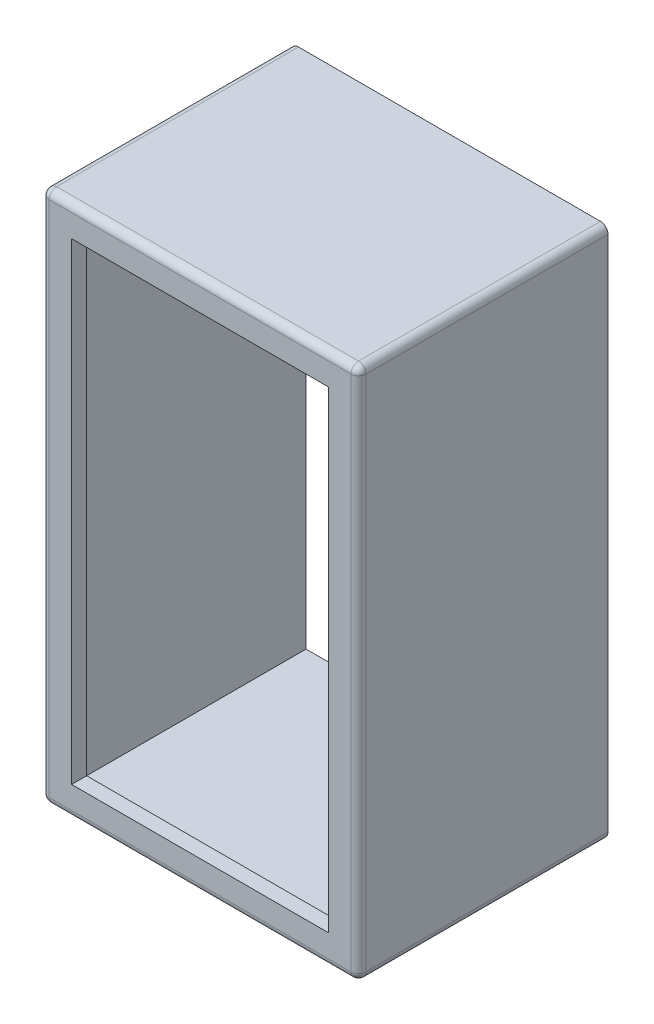
ISO-10303-21;
HEADER;
FILE_DESCRIPTION(('STEP AP214'),'2;1');
FILE_NAME('part.step','',(''),(''),'','','');
FILE_SCHEMA(('AUTOMOTIVE_DESIGN { 1 0 10303 214 1 1 1 1 }'));
ENDSEC;
DATA;
#1=APPLICATION_CONTEXT('core data for automotive mechanical design processes');
#2=APPLICATION_PROTOCOL_DEFINITION('international standard','automotive_design',2000,#1);
#3=PRODUCT_CONTEXT('',#1,'mechanical');
#4=PRODUCT('Part','Part','',(#3));
#5=PRODUCT_RELATED_PRODUCT_CATEGORY('part','',(#4));
#6=PRODUCT_DEFINITION_FORMATION('','',#4);
#7=PRODUCT_DEFINITION_CONTEXT('part definition',#1,'design');
#8=PRODUCT_DEFINITION('design','',#6,#7);
#9=PRODUCT_DEFINITION_SHAPE('','',#8);
#10=(LENGTH_UNIT() NAMED_UNIT(*) SI_UNIT(.MILLI.,.METRE.));
#11=(NAMED_UNIT(*) PLANE_ANGLE_UNIT() SI_UNIT($,.RADIAN.));
#12=(NAMED_UNIT(*) SI_UNIT($,.STERADIAN.) SOLID_ANGLE_UNIT());
#13=UNCERTAINTY_MEASURE_WITH_UNIT(LENGTH_MEASURE(1.E-05),#10,'distance_accuracy_value','');
#14=(GEOMETRIC_REPRESENTATION_CONTEXT(3) GLOBAL_UNCERTAINTY_ASSIGNED_CONTEXT((#13)) GLOBAL_UNIT_ASSIGNED_CONTEXT((#10,
#11,#12)) REPRESENTATION_CONTEXT('',''));
#15=CARTESIAN_POINT('',(0.,0.,0.));
#16=DIRECTION('',(0.,0.,1.));
#17=DIRECTION('',(1.,0.,0.));
#18=AXIS2_PLACEMENT_3D('',#15,#16,#17);
#19=CARTESIAN_POINT('',(9.30389435070419,50.8956969127035,7.9375));
#20=DIRECTION('',(1.,0.,0.));
#21=DIRECTION('',(0.,1.,0.));
#22=AXIS2_PLACEMENT_3D('',#19,#20,#21);
#23=PLANE('',#22);
#24=DIRECTION('',(0.,-1.,0.));
#25=VECTOR('',#24,1.);
#26=CARTESIAN_POINT('',(9.30389435070419,50.8956969127035,8.1915));
#27=LINE('',#26,#25);
#28=CARTESIAN_POINT('',(9.3038943507042,33.1156969127037,8.1915));
#29=VERTEX_POINT('',#28);
#30=CARTESIAN_POINT('',(9.30389435070419,50.6416969127035,8.1915));
#31=VERTEX_POINT('',#30);
#32=EDGE_CURVE('E269',#29,#31,#27,.F.);
#33=ORIENTED_EDGE('',*,*,#32,.T.);
#34=DIRECTION('',(0.,0.,-1.));
#35=VECTOR('',#34,1.);
#36=CARTESIAN_POINT('',(9.30389435070419,50.6416969127035,7.9375));
#37=LINE('',#36,#35);
#38=CARTESIAN_POINT('',(9.30389435070419,50.6416969127035,0.));
#39=VERTEX_POINT('',#38);
#40=EDGE_CURVE('E273',#31,#39,#37,.T.);
#41=ORIENTED_EDGE('',*,*,#40,.T.);
#42=DIRECTION('',(0.,-1.,0.));
#43=VECTOR('',#42,1.);
#44=CARTESIAN_POINT('',(9.30389435070419,50.8956969127035,0.));
#45=LINE('',#44,#43);
#46=CARTESIAN_POINT('',(9.3038943507042,33.1156969127037,0.));
#47=VERTEX_POINT('',#46);
#48=EDGE_CURVE('E227',#39,#47,#45,.T.);
#49=ORIENTED_EDGE('',*,*,#48,.T.);
#50=DIRECTION('',(0.,0.,-1.));
#51=VECTOR('',#50,1.);
#52=CARTESIAN_POINT('',(9.3038943507042,33.1156969127037,7.9375));
#53=LINE('',#52,#51);
#54=EDGE_CURVE('E271',#47,#29,#53,.F.);
#55=ORIENTED_EDGE('',*,*,#54,.T.);
#56=EDGE_LOOP('',(#33,#41,#49,#55));
#57=FACE_BOUND('',#56,.T.);
#58=ADVANCED_FACE('F56',(#57),#23,.F.);
#59=CARTESIAN_POINT('',(9.3038943507042,32.8616969127037,7.9375));
#60=DIRECTION('',(0.,1.,0.));
#61=DIRECTION('',(0.,0.,1.));
#62=AXIS2_PLACEMENT_3D('',#59,#60,#61);
#63=PLANE('',#62);
#64=DIRECTION('',(1.,0.,0.));
#65=VECTOR('',#64,1.);
#66=CARTESIAN_POINT('',(9.3038943507042,32.8616969127037,0.));
#67=LINE('',#66,#65);
#68=CARTESIAN_POINT('',(9.5578943507042,32.8616969127037,0.));
#69=VERTEX_POINT('',#68);
#70=CARTESIAN_POINT('',(19.7813943507042,32.8616969127037,0.));
#71=VERTEX_POINT('',#70);
#72=EDGE_CURVE('E260',#69,#71,#67,.T.);
#73=ORIENTED_EDGE('',*,*,#72,.T.);
#74=DIRECTION('',(0.,0.,-1.));
#75=VECTOR('',#74,1.);
#76=CARTESIAN_POINT('',(19.7813943507042,32.8616969127037,7.9375));
#77=LINE('',#76,#75);
#78=CARTESIAN_POINT('',(19.7813943507042,32.8616969127037,8.1915));
#79=VERTEX_POINT('',#78);
#80=EDGE_CURVE('E300',#71,#79,#77,.F.);
#81=ORIENTED_EDGE('',*,*,#80,.T.);
#82=DIRECTION('',(1.,0.,0.));
#83=VECTOR('',#82,1.);
#84=CARTESIAN_POINT('',(9.3038943507042,32.8616969127037,8.1915));
#85=LINE('',#84,#83);
#86=CARTESIAN_POINT('',(9.5578943507042,32.8616969127037,8.1915));
#87=VERTEX_POINT('',#86);
#88=EDGE_CURVE('E296',#79,#87,#85,.F.);
#89=ORIENTED_EDGE('',*,*,#88,.T.);
#90=DIRECTION('',(0.,0.,-1.));
#91=VECTOR('',#90,1.);
#92=CARTESIAN_POINT('',(9.5578943507042,32.8616969127037,7.9375));
#93=LINE('',#92,#91);
#94=EDGE_CURVE('E298',#87,#69,#93,.T.);
#95=ORIENTED_EDGE('',*,*,#94,.T.);
#96=EDGE_LOOP('',(#73,#81,#89,#95));
#97=FACE_BOUND('',#96,.T.);
#98=ADVANCED_FACE('F392',(#97),#63,.F.);
#99=CARTESIAN_POINT('',(20.0353943507042,50.8956969127035,7.9375));
#100=DIRECTION('',(-1.,0.,0.));
#101=DIRECTION('',(0.,0.,1.));
#102=AXIS2_PLACEMENT_3D('',#99,#100,#101);
#103=PLANE('',#102);
#104=DIRECTION('',(0.,1.,0.));
#105=VECTOR('',#104,1.);
#106=CARTESIAN_POINT('',(20.0353943507042,50.8956969127035,0.));
#107=LINE('',#106,#105);
#108=CARTESIAN_POINT('',(20.0353943507042,33.1156969127037,0.));
#109=VERTEX_POINT('',#108);
#110=CARTESIAN_POINT('',(20.0353943507042,50.6416969127035,0.));
#111=VERTEX_POINT('',#110);
#112=EDGE_CURVE('E263',#109,#111,#107,.T.);
#113=ORIENTED_EDGE('',*,*,#112,.T.);
#114=DIRECTION('',(0.,0.,-1.));
#115=VECTOR('',#114,1.);
#116=CARTESIAN_POINT('',(20.0353943507042,50.6416969127035,7.9375));
#117=LINE('',#116,#115);
#118=CARTESIAN_POINT('',(20.0353943507042,50.6416969127035,8.1915));
#119=VERTEX_POINT('',#118);
#120=EDGE_CURVE('E294',#111,#119,#117,.F.);
#121=ORIENTED_EDGE('',*,*,#120,.T.);
#122=DIRECTION('',(0.,1.,0.));
#123=VECTOR('',#122,1.);
#124=CARTESIAN_POINT('',(20.0353943507042,32.8616969127037,8.1915));
#125=LINE('',#124,#123);
#126=CARTESIAN_POINT('',(20.0353943507042,33.1156969127037,8.1915));
#127=VERTEX_POINT('',#126);
#128=EDGE_CURVE('E290',#119,#127,#125,.F.);
#129=ORIENTED_EDGE('',*,*,#128,.T.);
#130=DIRECTION('',(0.,0.,-1.));
#131=VECTOR('',#130,1.);
#132=CARTESIAN_POINT('',(20.0353943507042,33.1156969127037,7.9375));
#133=LINE('',#132,#131);
#134=EDGE_CURVE('E292',#127,#109,#133,.T.);
#135=ORIENTED_EDGE('',*,*,#134,.T.);
#136=EDGE_LOOP('',(#113,#121,#129,#135));
#137=FACE_BOUND('',#136,.T.);
#138=ADVANCED_FACE('F350',(#137),#103,.F.);
#139=CARTESIAN_POINT('',(9.30389435070419,50.8956969127035,7.9375));
#140=DIRECTION('',(0.,-1.,0.));
#141=DIRECTION('',(0.,0.,-1.));
#142=AXIS2_PLACEMENT_3D('',#139,#140,#141);
#143=PLANE('',#142);
#144=DIRECTION('',(-1.,0.,0.));
#145=VECTOR('',#144,1.);
#146=CARTESIAN_POINT('',(9.30389435070419,50.8956969127035,0.));
#147=LINE('',#146,#145);
#148=CARTESIAN_POINT('',(19.7813943507042,50.8956969127035,0.));
#149=VERTEX_POINT('',#148);
#150=CARTESIAN_POINT('',(9.5578943507042,50.8956969127035,0.));
#151=VERTEX_POINT('',#150);
#152=EDGE_CURVE('E266',#149,#151,#147,.T.);
#153=ORIENTED_EDGE('',*,*,#152,.T.);
#154=DIRECTION('',(0.,0.,-1.));
#155=VECTOR('',#154,1.);
#156=CARTESIAN_POINT('',(9.5578943507042,50.8956969127035,7.9375));
#157=LINE('',#156,#155);
#158=CARTESIAN_POINT('',(9.5578943507042,50.8956969127035,8.1915));
#159=VERTEX_POINT('',#158);
#160=EDGE_CURVE('E288',#151,#159,#157,.F.);
#161=ORIENTED_EDGE('',*,*,#160,.T.);
#162=DIRECTION('',(-1.,0.,0.));
#163=VECTOR('',#162,1.);
#164=CARTESIAN_POINT('',(20.0353943507042,50.8956969127035,8.1915));
#165=LINE('',#164,#163);
#166=CARTESIAN_POINT('',(19.7813943507042,50.8956969127035,8.1915));
#167=VERTEX_POINT('',#166);
#168=EDGE_CURVE('E284',#159,#167,#165,.F.);
#169=ORIENTED_EDGE('',*,*,#168,.T.);
#170=DIRECTION('',(0.,0.,-1.));
#171=VECTOR('',#170,1.);
#172=CARTESIAN_POINT('',(19.7813943507042,50.8956969127035,7.9375));
#173=LINE('',#172,#171);
#174=EDGE_CURVE('E286',#167,#149,#173,.T.);
#175=ORIENTED_EDGE('',*,*,#174,.T.);
#176=EDGE_LOOP('',(#153,#161,#169,#175));
#177=FACE_BOUND('',#176,.T.);
#178=ADVANCED_FACE('F396',(#177),#143,.F.);
#179=CARTESIAN_POINT('',(0.,0.,0.));
#180=DIRECTION('',(0.,0.,1.));
#181=DIRECTION('',(1.,0.,0.));
#182=AXIS2_PLACEMENT_3D('',#179,#180,#181);
#183=PLANE('',#182);
#184=DIRECTION('',(-1.,0.,0.));
#185=VECTOR('',#184,1.);
#186=CARTESIAN_POINT('',(9.30389435070419,50.3876969127035,0.));
#187=LINE('',#186,#185);
#188=CARTESIAN_POINT('',(19.5273943507042,50.3876969127035,0.));
#189=VERTEX_POINT('',#188);
#190=CARTESIAN_POINT('',(9.8118943507042,50.3876969127035,0.));
#191=VERTEX_POINT('',#190);
#192=EDGE_CURVE('E239',#189,#191,#187,.T.);
#193=ORIENTED_EDGE('',*,*,#192,.T.);
#194=DIRECTION('',(0.,-1.,0.));
#195=VECTOR('',#194,1.);
#196=CARTESIAN_POINT('',(9.8118943507042,50.8956969127035,0.));
#197=LINE('',#196,#195);
#198=CARTESIAN_POINT('',(9.8118943507042,33.3696969127037,0.));
#199=VERTEX_POINT('',#198);
#200=EDGE_CURVE('E200',#191,#199,#197,.T.);
#201=ORIENTED_EDGE('',*,*,#200,.T.);
#202=DIRECTION('',(1.,0.,0.));
#203=VECTOR('',#202,1.);
#204=CARTESIAN_POINT('',(9.3038943507042,33.3696969127037,0.));
#205=LINE('',#204,#203);
#206=CARTESIAN_POINT('',(19.5273943507042,33.3696969127037,0.));
#207=VERTEX_POINT('',#206);
#208=EDGE_CURVE('E238',#199,#207,#205,.T.);
#209=ORIENTED_EDGE('',*,*,#208,.T.);
#210=DIRECTION('',(0.,1.,0.));
#211=VECTOR('',#210,1.);
#212=CARTESIAN_POINT('',(19.5273943507042,50.8956969127035,0.));
#213=LINE('',#212,#211);
#214=EDGE_CURVE('E243',#207,#189,#213,.T.);
#215=ORIENTED_EDGE('',*,*,#214,.T.);
#216=EDGE_LOOP('',(#193,#201,#209,#215));
#217=FACE_BOUND('',#216,.T.);
#218=ORIENTED_EDGE('',*,*,#48,.F.);
#219=CARTESIAN_POINT('',(9.5578943507042,50.6416969127035,0.));
#220=DIRECTION('',(0.,0.,1.));
#221=DIRECTION('',(1.,0.,0.));
#222=AXIS2_PLACEMENT_3D('',#219,#220,#221);
#223=CIRCLE('',#222,0.254);
#224=EDGE_CURVE('E282',#39,#151,#223,.F.);
#225=ORIENTED_EDGE('',*,*,#224,.T.);
#226=ORIENTED_EDGE('',*,*,#152,.F.);
#227=CARTESIAN_POINT('',(19.7813943507042,50.6416969127035,0.));
#228=DIRECTION('',(0.,0.,1.));
#229=DIRECTION('',(1.,0.,0.));
#230=AXIS2_PLACEMENT_3D('',#227,#228,#229);
#231=CIRCLE('',#230,0.254);
#232=EDGE_CURVE('E280',#149,#111,#231,.F.);
#233=ORIENTED_EDGE('',*,*,#232,.T.);
#234=ORIENTED_EDGE('',*,*,#112,.F.);
#235=CARTESIAN_POINT('',(19.7813943507042,33.1156969127037,0.));
#236=DIRECTION('',(0.,0.,1.));
#237=DIRECTION('',(1.,0.,0.));
#238=AXIS2_PLACEMENT_3D('',#235,#236,#237);
#239=CIRCLE('',#238,0.254);
#240=EDGE_CURVE('E278',#109,#71,#239,.F.);
#241=ORIENTED_EDGE('',*,*,#240,.T.);
#242=ORIENTED_EDGE('',*,*,#72,.F.);
#243=CARTESIAN_POINT('',(9.5578943507042,33.1156969127037,0.));
#244=DIRECTION('',(0.,0.,1.));
#245=DIRECTION('',(1.,0.,0.));
#246=AXIS2_PLACEMENT_3D('',#243,#244,#245);
#247=CIRCLE('',#246,0.254);
#248=EDGE_CURVE('E276',#69,#47,#247,.F.);
#249=ORIENTED_EDGE('',*,*,#248,.T.);
#250=EDGE_LOOP('',(#218,#225,#226,#233,#234,#241,#242,#249));
#251=FACE_BOUND('',#250,.T.);
#252=ADVANCED_FACE('F354',(#217,#251),#183,.F.);
#253=CARTESIAN_POINT('',(9.8118943507042,50.8956969127035,7.9375));
#254=DIRECTION('',(1.,0.,0.));
#255=DIRECTION('',(0.,1.,0.));
#256=AXIS2_PLACEMENT_3D('',#253,#254,#255);
#257=PLANE('',#256);
#258=ORIENTED_EDGE('',*,*,#200,.F.);
#259=DIRECTION('',(0.,0.,-1.));
#260=VECTOR('',#259,1.);
#261=CARTESIAN_POINT('',(9.8118943507042,50.3876969127035,7.9375));
#262=LINE('',#261,#260);
#263=CARTESIAN_POINT('',(9.8118943507042,50.3876969127035,7.9375));
#264=VERTEX_POINT('',#263);
#265=EDGE_CURVE('E229',#264,#191,#262,.T.);
#266=ORIENTED_EDGE('',*,*,#265,.F.);
#267=DIRECTION('',(0.,-1.,0.));
#268=VECTOR('',#267,1.);
#269=CARTESIAN_POINT('',(9.8118943507042,50.8956969127035,7.9375));
#270=LINE('',#269,#268);
#271=CARTESIAN_POINT('',(9.8118943507042,33.3696969127037,7.9375));
#272=VERTEX_POINT('',#271);
#273=EDGE_CURVE('E242',#264,#272,#270,.T.);
#274=ORIENTED_EDGE('',*,*,#273,.T.);
#275=DIRECTION('',(0.,0.,-1.));
#276=VECTOR('',#275,1.);
#277=CARTESIAN_POINT('',(9.8118943507042,33.3696969127037,7.9375));
#278=LINE('',#277,#276);
#279=EDGE_CURVE('E224',#272,#199,#278,.T.);
#280=ORIENTED_EDGE('',*,*,#279,.T.);
#281=EDGE_LOOP('',(#258,#266,#274,#280));
#282=FACE_BOUND('',#281,.T.);
#283=ADVANCED_FACE('F421',(#282),#257,.T.);
#284=CARTESIAN_POINT('',(9.3038943507042,33.3696969127037,7.9375));
#285=DIRECTION('',(0.,1.,0.));
#286=DIRECTION('',(0.,0.,1.));
#287=AXIS2_PLACEMENT_3D('',#284,#285,#286);
#288=PLANE('',#287);
#289=ORIENTED_EDGE('',*,*,#208,.F.);
#290=ORIENTED_EDGE('',*,*,#279,.F.);
#291=DIRECTION('',(1.,0.,0.));
#292=VECTOR('',#291,1.);
#293=CARTESIAN_POINT('',(9.3038943507042,33.3696969127037,7.9375));
#294=LINE('',#293,#292);
#295=CARTESIAN_POINT('',(19.5273943507042,33.3696969127037,7.9375));
#296=VERTEX_POINT('',#295);
#297=EDGE_CURVE('E250',#272,#296,#294,.T.);
#298=ORIENTED_EDGE('',*,*,#297,.T.);
#299=DIRECTION('',(0.,0.,-1.));
#300=VECTOR('',#299,1.);
#301=CARTESIAN_POINT('',(19.5273943507042,33.3696969127037,7.9375));
#302=LINE('',#301,#300);
#303=EDGE_CURVE('E228',#296,#207,#302,.T.);
#304=ORIENTED_EDGE('',*,*,#303,.T.);
#305=EDGE_LOOP('',(#289,#290,#298,#304));
#306=FACE_BOUND('',#305,.T.);
#307=ADVANCED_FACE('F430',(#306),#288,.T.);
#308=CARTESIAN_POINT('',(19.5273943507042,50.8956969127035,7.9375));
#309=DIRECTION('',(-1.,0.,0.));
#310=DIRECTION('',(0.,0.,1.));
#311=AXIS2_PLACEMENT_3D('',#308,#309,#310);
#312=PLANE('',#311);
#313=ORIENTED_EDGE('',*,*,#214,.F.);
#314=ORIENTED_EDGE('',*,*,#303,.F.);
#315=DIRECTION('',(0.,1.,0.));
#316=VECTOR('',#315,1.);
#317=CARTESIAN_POINT('',(19.5273943507042,50.8956969127035,7.9375));
#318=LINE('',#317,#316);
#319=CARTESIAN_POINT('',(19.5273943507042,50.3876969127035,7.9375));
#320=VERTEX_POINT('',#319);
#321=EDGE_CURVE('E253',#296,#320,#318,.T.);
#322=ORIENTED_EDGE('',*,*,#321,.T.);
#323=DIRECTION('',(0.,0.,-1.));
#324=VECTOR('',#323,1.);
#325=CARTESIAN_POINT('',(19.5273943507042,50.3876969127035,7.9375));
#326=LINE('',#325,#324);
#327=EDGE_CURVE('E231',#320,#189,#326,.T.);
#328=ORIENTED_EDGE('',*,*,#327,.T.);
#329=EDGE_LOOP('',(#313,#314,#322,#328));
#330=FACE_BOUND('',#329,.T.);
#331=ADVANCED_FACE('F426',(#330),#312,.T.);
#332=CARTESIAN_POINT('',(9.30389435070419,50.3876969127035,7.9375));
#333=DIRECTION('',(0.,-1.,0.));
#334=DIRECTION('',(0.,0.,-1.));
#335=AXIS2_PLACEMENT_3D('',#332,#333,#334);
#336=PLANE('',#335);
#337=ORIENTED_EDGE('',*,*,#192,.F.);
#338=ORIENTED_EDGE('',*,*,#327,.F.);
#339=DIRECTION('',(-1.,0.,0.));
#340=VECTOR('',#339,1.);
#341=CARTESIAN_POINT('',(9.30389435070419,50.3876969127035,7.9375));
#342=LINE('',#341,#340);
#343=EDGE_CURVE('E232',#320,#264,#342,.T.);
#344=ORIENTED_EDGE('',*,*,#343,.T.);
#345=ORIENTED_EDGE('',*,*,#265,.T.);
#346=EDGE_LOOP('',(#337,#338,#344,#345));
#347=FACE_BOUND('',#346,.T.);
#348=ADVANCED_FACE('F423',(#347),#336,.T.);
#349=CARTESIAN_POINT('',(0.,0.,8.4455));
#350=DIRECTION('',(0.,0.,1.));
#351=DIRECTION('',(1.,0.,0.));
#352=AXIS2_PLACEMENT_3D('',#349,#350,#351);
#353=PLANE('',#352);
#354=DIRECTION('',(0.,1.,0.));
#355=VECTOR('',#354,1.);
#356=CARTESIAN_POINT('',(19.7813943507042,50.8956969127035,8.4455));
#357=LINE('',#356,#355);
#358=CARTESIAN_POINT('',(19.7813943507042,33.1156969127037,8.4455));
#359=VERTEX_POINT('',#358);
#360=CARTESIAN_POINT('',(19.7813943507042,50.6416969127035,8.4455));
#361=VERTEX_POINT('',#360);
#362=EDGE_CURVE('E65',#359,#361,#357,.T.);
#363=ORIENTED_EDGE('',*,*,#362,.T.);
#364=DIRECTION('',(-1.,0.,0.));
#365=VECTOR('',#364,1.);
#366=CARTESIAN_POINT('',(9.30389435070419,50.6416969127035,8.4455));
#367=LINE('',#366,#365);
#368=CARTESIAN_POINT('',(9.5578943507042,50.6416969127035,8.4455));
#369=VERTEX_POINT('',#368);
#370=EDGE_CURVE('E12',#361,#369,#367,.T.);
#371=ORIENTED_EDGE('',*,*,#370,.T.);
#372=DIRECTION('',(0.,-1.,0.));
#373=VECTOR('',#372,1.);
#374=CARTESIAN_POINT('',(9.5578943507042,32.8616969127037,8.4455));
#375=LINE('',#374,#373);
#376=CARTESIAN_POINT('',(9.5578943507042,33.1156969127037,8.4455));
#377=VERTEX_POINT('',#376);
#378=EDGE_CURVE('E302',#369,#377,#375,.T.);
#379=ORIENTED_EDGE('',*,*,#378,.T.);
#380=DIRECTION('',(1.,0.,0.));
#381=VECTOR('',#380,1.);
#382=CARTESIAN_POINT('',(20.0353943507042,33.1156969127037,8.4455));
#383=LINE('',#382,#381);
#384=EDGE_CURVE('E76',#377,#359,#383,.T.);
#385=ORIENTED_EDGE('',*,*,#384,.T.);
#386=EDGE_LOOP('',(#363,#371,#379,#385));
#387=FACE_BOUND('',#386,.T.);
#388=DIRECTION('',(0.,1.,0.));
#389=VECTOR('',#388,1.);
#390=CARTESIAN_POINT('',(19.0193943507042,33.3696969127037,8.4455));
#391=LINE('',#390,#389);
#392=CARTESIAN_POINT('',(19.0193943507042,33.8776969127037,8.4455));
#393=VERTEX_POINT('',#392);
#394=CARTESIAN_POINT('',(19.0193943507042,49.8796969127035,8.4455));
#395=VERTEX_POINT('',#394);
#396=EDGE_CURVE('E192',#393,#395,#391,.T.);
#397=ORIENTED_EDGE('',*,*,#396,.F.);
#398=DIRECTION('',(1.,0.,0.));
#399=VECTOR('',#398,1.);
#400=CARTESIAN_POINT('',(9.8118943507042,33.8776969127037,8.4455));
#401=LINE('',#400,#399);
#402=CARTESIAN_POINT('',(10.3198943507042,33.8776969127037,8.4455));
#403=VERTEX_POINT('',#402);
#404=EDGE_CURVE('E182',#403,#393,#401,.T.);
#405=ORIENTED_EDGE('',*,*,#404,.F.);
#406=DIRECTION('',(0.,-1.,0.));
#407=VECTOR('',#406,1.);
#408=CARTESIAN_POINT('',(10.3198943507042,50.3876969127035,8.4455));
#409=LINE('',#408,#407);
#410=CARTESIAN_POINT('',(10.3198943507042,49.8796969127035,8.4455));
#411=VERTEX_POINT('',#410);
#412=EDGE_CURVE('E208',#411,#403,#409,.T.);
#413=ORIENTED_EDGE('',*,*,#412,.F.);
#414=DIRECTION('',(-1.,0.,0.));
#415=VECTOR('',#414,1.);
#416=CARTESIAN_POINT('',(19.5273943507042,49.8796969127035,8.4455));
#417=LINE('',#416,#415);
#418=EDGE_CURVE('E206',#395,#411,#417,.T.);
#419=ORIENTED_EDGE('',*,*,#418,.F.);
#420=EDGE_LOOP('',(#397,#405,#413,#419));
#421=FACE_BOUND('',#420,.T.);
#422=ADVANCED_FACE('F204',(#387,#421),#353,.T.);
#423=CARTESIAN_POINT('',(0.,0.,7.9375));
#424=DIRECTION('',(0.,0.,1.));
#425=DIRECTION('',(1.,0.,0.));
#426=AXIS2_PLACEMENT_3D('',#423,#424,#425);
#427=PLANE('',#426);
#428=ORIENTED_EDGE('',*,*,#273,.F.);
#429=ORIENTED_EDGE('',*,*,#343,.F.);
#430=ORIENTED_EDGE('',*,*,#321,.F.);
#431=ORIENTED_EDGE('',*,*,#297,.F.);
#432=EDGE_LOOP('',(#428,#429,#430,#431));
#433=FACE_BOUND('',#432,.T.);
#434=DIRECTION('',(1.,0.,0.));
#435=VECTOR('',#434,1.);
#436=CARTESIAN_POINT('',(9.8118943507042,33.8776969127037,7.9375));
#437=LINE('',#436,#435);
#438=CARTESIAN_POINT('',(10.3198943507042,33.8776969127037,7.9375));
#439=VERTEX_POINT('',#438);
#440=CARTESIAN_POINT('',(19.0193943507042,33.8776969127037,7.9375));
#441=VERTEX_POINT('',#440);
#442=EDGE_CURVE('E212',#439,#441,#437,.T.);
#443=ORIENTED_EDGE('',*,*,#442,.T.);
#444=DIRECTION('',(0.,1.,0.));
#445=VECTOR('',#444,1.);
#446=CARTESIAN_POINT('',(19.0193943507042,33.3696969127037,7.9375));
#447=LINE('',#446,#445);
#448=CARTESIAN_POINT('',(19.0193943507042,49.8796969127035,7.9375));
#449=VERTEX_POINT('',#448);
#450=EDGE_CURVE('E199',#441,#449,#447,.T.);
#451=ORIENTED_EDGE('',*,*,#450,.T.);
#452=DIRECTION('',(-1.,0.,0.));
#453=VECTOR('',#452,1.);
#454=CARTESIAN_POINT('',(19.5273943507042,49.8796969127035,7.9375));
#455=LINE('',#454,#453);
#456=CARTESIAN_POINT('',(10.3198943507042,49.8796969127035,7.9375));
#457=VERTEX_POINT('',#456);
#458=EDGE_CURVE('E215',#449,#457,#455,.T.);
#459=ORIENTED_EDGE('',*,*,#458,.T.);
#460=DIRECTION('',(0.,-1.,0.));
#461=VECTOR('',#460,1.);
#462=CARTESIAN_POINT('',(10.3198943507042,50.3876969127035,7.9375));
#463=LINE('',#462,#461);
#464=EDGE_CURVE('E193',#457,#439,#463,.T.);
#465=ORIENTED_EDGE('',*,*,#464,.T.);
#466=EDGE_LOOP('',(#443,#451,#459,#465));
#467=FACE_BOUND('',#466,.T.);
#468=ADVANCED_FACE('F438',(#433,#467),#427,.F.);
#469=CARTESIAN_POINT('',(9.8118943507042,33.8776969127037,8.4455));
#470=DIRECTION('',(0.,1.,0.));
#471=DIRECTION('',(0.,0.,1.));
#472=AXIS2_PLACEMENT_3D('',#469,#470,#471);
#473=PLANE('',#472);
#474=ORIENTED_EDGE('',*,*,#442,.F.);
#475=DIRECTION('',(0.,0.,-1.));
#476=VECTOR('',#475,1.);
#477=CARTESIAN_POINT('',(10.3198943507042,33.8776969127037,8.4455));
#478=LINE('',#477,#476);
#479=EDGE_CURVE('E188',#403,#439,#478,.T.);
#480=ORIENTED_EDGE('',*,*,#479,.F.);
#481=ORIENTED_EDGE('',*,*,#404,.T.);
#482=DIRECTION('',(0.,0.,-1.));
#483=VECTOR('',#482,1.);
#484=CARTESIAN_POINT('',(19.0193943507042,33.8776969127037,8.4455));
#485=LINE('',#484,#483);
#486=EDGE_CURVE('E185',#393,#441,#485,.T.);
#487=ORIENTED_EDGE('',*,*,#486,.T.);
#488=EDGE_LOOP('',(#474,#480,#481,#487));
#489=FACE_BOUND('',#488,.T.);
#490=ADVANCED_FACE('F184',(#489),#473,.T.);
#491=CARTESIAN_POINT('',(19.0193943507042,33.3696969127037,8.4455));
#492=DIRECTION('',(-1.,0.,0.));
#493=DIRECTION('',(0.,0.,1.));
#494=AXIS2_PLACEMENT_3D('',#491,#492,#493);
#495=PLANE('',#494);
#496=ORIENTED_EDGE('',*,*,#450,.F.);
#497=ORIENTED_EDGE('',*,*,#486,.F.);
#498=ORIENTED_EDGE('',*,*,#396,.T.);
#499=DIRECTION('',(0.,0.,-1.));
#500=VECTOR('',#499,1.);
#501=CARTESIAN_POINT('',(19.0193943507042,49.8796969127035,8.4455));
#502=LINE('',#501,#500);
#503=EDGE_CURVE('E201',#395,#449,#502,.T.);
#504=ORIENTED_EDGE('',*,*,#503,.T.);
#505=EDGE_LOOP('',(#496,#497,#498,#504));
#506=FACE_BOUND('',#505,.T.);
#507=ADVANCED_FACE('F196',(#506),#495,.T.);
#508=CARTESIAN_POINT('',(19.5273943507042,49.8796969127035,8.4455));
#509=DIRECTION('',(0.,-1.,0.));
#510=DIRECTION('',(0.,0.,-1.));
#511=AXIS2_PLACEMENT_3D('',#508,#509,#510);
#512=PLANE('',#511);
#513=ORIENTED_EDGE('',*,*,#458,.F.);
#514=ORIENTED_EDGE('',*,*,#503,.F.);
#515=ORIENTED_EDGE('',*,*,#418,.T.);
#516=DIRECTION('',(0.,0.,-1.));
#517=VECTOR('',#516,1.);
#518=CARTESIAN_POINT('',(10.3198943507042,49.8796969127035,8.4455));
#519=LINE('',#518,#517);
#520=EDGE_CURVE('E221',#411,#457,#519,.T.);
#521=ORIENTED_EDGE('',*,*,#520,.T.);
#522=EDGE_LOOP('',(#513,#514,#515,#521));
#523=FACE_BOUND('',#522,.T.);
#524=ADVANCED_FACE('F448',(#523),#512,.T.);
#525=CARTESIAN_POINT('',(10.3198943507042,50.3876969127035,8.4455));
#526=DIRECTION('',(1.,0.,0.));
#527=DIRECTION('',(0.,1.,0.));
#528=AXIS2_PLACEMENT_3D('',#525,#526,#527);
#529=PLANE('',#528);
#530=ORIENTED_EDGE('',*,*,#464,.F.);
#531=ORIENTED_EDGE('',*,*,#520,.F.);
#532=ORIENTED_EDGE('',*,*,#412,.T.);
#533=ORIENTED_EDGE('',*,*,#479,.T.);
#534=EDGE_LOOP('',(#530,#531,#532,#533));
#535=FACE_BOUND('',#534,.T.);
#536=ADVANCED_FACE('F451',(#535),#529,.T.);
#537=CARTESIAN_POINT('',(19.7813943507042,33.1156969127037,7.9375));
#538=DIRECTION('',(0.,0.,-1.));
#539=DIRECTION('',(-1.,0.,0.));
#540=AXIS2_PLACEMENT_3D('',#537,#538,#539);
#541=CYLINDRICAL_SURFACE('',#540,0.254);
#542=CARTESIAN_POINT('',(19.7813943507042,33.1156969127037,8.1915));
#543=DIRECTION('',(0.,0.,1.));
#544=DIRECTION('',(1.,0.,0.));
#545=AXIS2_PLACEMENT_3D('',#542,#543,#544);
#546=CIRCLE('',#545,0.254);
#547=EDGE_CURVE('E60',#79,#127,#546,.T.);
#548=ORIENTED_EDGE('',*,*,#547,.F.);
#549=ORIENTED_EDGE('',*,*,#80,.F.);
#550=ORIENTED_EDGE('',*,*,#240,.F.);
#551=ORIENTED_EDGE('',*,*,#134,.F.);
#552=EDGE_LOOP('',(#548,#549,#550,#551));
#553=FACE_BOUND('',#552,.T.);
#554=ADVANCED_FACE('F58',(#553),#541,.T.);
#555=CARTESIAN_POINT('',(19.7813943507042,33.1156969127037,8.1915));
#556=DIRECTION('',(0.,0.,1.));
#557=DIRECTION('',(1.,0.,0.));
#558=AXIS2_PLACEMENT_3D('',#555,#556,#557);
#559=SPHERICAL_SURFACE('',#558,0.254);
#560=CARTESIAN_POINT('',(19.7813943507042,33.1156969127037,8.1915));
#561=DIRECTION('',(1.,0.,0.));
#562=DIRECTION('',(0.,0.,-1.));
#563=AXIS2_PLACEMENT_3D('',#560,#561,#562);
#564=CIRCLE('',#563,0.254);
#565=EDGE_CURVE('E332',#79,#359,#564,.F.);
#566=ORIENTED_EDGE('',*,*,#565,.F.);
#567=ORIENTED_EDGE('',*,*,#547,.T.);
#568=CARTESIAN_POINT('',(19.7813943507042,33.1156969127037,8.1915));
#569=DIRECTION('',(0.,-1.,0.));
#570=DIRECTION('',(0.,0.,-1.));
#571=AXIS2_PLACEMENT_3D('',#568,#569,#570);
#572=CIRCLE('',#571,0.254);
#573=EDGE_CURVE('E333',#359,#127,#572,.F.);
#574=ORIENTED_EDGE('',*,*,#573,.F.);
#575=EDGE_LOOP('',(#566,#567,#574));
#576=FACE_BOUND('',#575,.T.);
#577=ADVANCED_FACE('F342',(#576),#559,.T.);
#578=CARTESIAN_POINT('',(19.7813943507042,50.6416969127035,7.9375));
#579=DIRECTION('',(0.,0.,-1.));
#580=DIRECTION('',(-1.,0.,0.));
#581=AXIS2_PLACEMENT_3D('',#578,#579,#580);
#582=CYLINDRICAL_SURFACE('',#581,0.254);
#583=ORIENTED_EDGE('',*,*,#232,.F.);
#584=ORIENTED_EDGE('',*,*,#174,.F.);
#585=CARTESIAN_POINT('',(19.7813943507042,50.6416969127035,8.1915));
#586=DIRECTION('',(0.,0.,1.));
#587=DIRECTION('',(1.,0.,0.));
#588=AXIS2_PLACEMENT_3D('',#585,#586,#587);
#589=CIRCLE('',#588,0.254);
#590=EDGE_CURVE('E329',#119,#167,#589,.T.);
#591=ORIENTED_EDGE('',*,*,#590,.F.);
#592=ORIENTED_EDGE('',*,*,#120,.F.);
#593=EDGE_LOOP('',(#583,#584,#591,#592));
#594=FACE_BOUND('',#593,.T.);
#595=ADVANCED_FACE('F360',(#594),#582,.T.);
#596=CARTESIAN_POINT('',(19.7813943507042,0.,8.1915));
#597=DIRECTION('',(0.,-1.,0.));
#598=DIRECTION('',(0.,0.,-1.));
#599=AXIS2_PLACEMENT_3D('',#596,#597,#598);
#600=CYLINDRICAL_SURFACE('',#599,0.254);
#601=ORIENTED_EDGE('',*,*,#573,.T.);
#602=ORIENTED_EDGE('',*,*,#128,.F.);
#603=CARTESIAN_POINT('',(19.7813943507042,50.6416969127035,8.1915));
#604=DIRECTION('',(0.,1.,0.));
#605=DIRECTION('',(0.,0.,1.));
#606=AXIS2_PLACEMENT_3D('',#603,#604,#605);
#607=CIRCLE('',#606,0.254);
#608=EDGE_CURVE('E326',#361,#119,#607,.T.);
#609=ORIENTED_EDGE('',*,*,#608,.F.);
#610=ORIENTED_EDGE('',*,*,#362,.F.);
#611=EDGE_LOOP('',(#601,#602,#609,#610));
#612=FACE_BOUND('',#611,.T.);
#613=ADVANCED_FACE('F362',(#612),#600,.T.);
#614=CARTESIAN_POINT('',(0.,33.1156969127037,8.1915));
#615=DIRECTION('',(-1.,0.,0.));
#616=DIRECTION('',(0.,0.,1.));
#617=AXIS2_PLACEMENT_3D('',#614,#615,#616);
#618=CYLINDRICAL_SURFACE('',#617,0.254);
#619=ORIENTED_EDGE('',*,*,#565,.T.);
#620=ORIENTED_EDGE('',*,*,#384,.F.);
#621=CARTESIAN_POINT('',(9.5578943507042,33.1156969127037,8.1915));
#622=DIRECTION('',(-1.,0.,0.));
#623=DIRECTION('',(0.,0.,1.));
#624=AXIS2_PLACEMENT_3D('',#621,#622,#623);
#625=CIRCLE('',#624,0.254);
#626=EDGE_CURVE('E323',#87,#377,#625,.T.);
#627=ORIENTED_EDGE('',*,*,#626,.F.);
#628=ORIENTED_EDGE('',*,*,#88,.F.);
#629=EDGE_LOOP('',(#619,#620,#627,#628));
#630=FACE_BOUND('',#629,.T.);
#631=ADVANCED_FACE('F376',(#630),#618,.T.);
#632=CARTESIAN_POINT('',(9.5578943507042,33.1156969127037,7.9375));
#633=DIRECTION('',(0.,0.,-1.));
#634=DIRECTION('',(-1.,0.,0.));
#635=AXIS2_PLACEMENT_3D('',#632,#633,#634);
#636=CYLINDRICAL_SURFACE('',#635,0.254);
#637=ORIENTED_EDGE('',*,*,#248,.F.);
#638=ORIENTED_EDGE('',*,*,#94,.F.);
#639=CARTESIAN_POINT('',(9.5578943507042,33.1156969127037,8.1915));
#640=DIRECTION('',(0.,0.,1.));
#641=DIRECTION('',(1.,0.,0.));
#642=AXIS2_PLACEMENT_3D('',#639,#640,#641);
#643=CIRCLE('',#642,0.254);
#644=EDGE_CURVE('E320',#29,#87,#643,.T.);
#645=ORIENTED_EDGE('',*,*,#644,.F.);
#646=ORIENTED_EDGE('',*,*,#54,.F.);
#647=EDGE_LOOP('',(#637,#638,#645,#646));
#648=FACE_BOUND('',#647,.T.);
#649=ADVANCED_FACE('F390',(#648),#636,.T.);
#650=CARTESIAN_POINT('',(19.7813943507042,50.6416969127035,8.1915));
#651=DIRECTION('',(0.,0.,1.));
#652=DIRECTION('',(1.,0.,0.));
#653=AXIS2_PLACEMENT_3D('',#650,#651,#652);
#654=SPHERICAL_SURFACE('',#653,0.254);
#655=ORIENTED_EDGE('',*,*,#608,.T.);
#656=ORIENTED_EDGE('',*,*,#590,.T.);
#657=CARTESIAN_POINT('',(19.7813943507042,50.6416969127035,8.1915));
#658=DIRECTION('',(1.,0.,0.));
#659=DIRECTION('',(0.,0.,-1.));
#660=AXIS2_PLACEMENT_3D('',#657,#658,#659);
#661=CIRCLE('',#660,0.254);
#662=EDGE_CURVE('E317',#361,#167,#661,.F.);
#663=ORIENTED_EDGE('',*,*,#662,.F.);
#664=EDGE_LOOP('',(#655,#656,#663));
#665=FACE_BOUND('',#664,.T.);
#666=ADVANCED_FACE('F366',(#665),#654,.T.);
#667=CARTESIAN_POINT('',(9.5578943507042,33.1156969127037,8.1915));
#668=DIRECTION('',(0.,0.,1.));
#669=DIRECTION('',(1.,0.,0.));
#670=AXIS2_PLACEMENT_3D('',#667,#668,#669);
#671=SPHERICAL_SURFACE('',#670,0.254);
#672=ORIENTED_EDGE('',*,*,#644,.T.);
#673=ORIENTED_EDGE('',*,*,#626,.T.);
#674=CARTESIAN_POINT('',(9.5578943507042,33.1156969127037,8.1915));
#675=DIRECTION('',(0.,-1.,0.));
#676=DIRECTION('',(0.,0.,-1.));
#677=AXIS2_PLACEMENT_3D('',#674,#675,#676);
#678=CIRCLE('',#677,0.254);
#679=EDGE_CURVE('E314',#29,#377,#678,.F.);
#680=ORIENTED_EDGE('',*,*,#679,.F.);
#681=EDGE_LOOP('',(#672,#673,#680));
#682=FACE_BOUND('',#681,.T.);
#683=ADVANCED_FACE('F379',(#682),#671,.T.);
#684=CARTESIAN_POINT('',(0.,50.6416969127035,8.1915));
#685=DIRECTION('',(1.,0.,0.));
#686=DIRECTION('',(0.,0.,-1.));
#687=AXIS2_PLACEMENT_3D('',#684,#685,#686);
#688=CYLINDRICAL_SURFACE('',#687,0.254);
#689=ORIENTED_EDGE('',*,*,#662,.T.);
#690=ORIENTED_EDGE('',*,*,#168,.F.);
#691=CARTESIAN_POINT('',(9.5578943507042,50.6416969127035,8.1915));
#692=DIRECTION('',(-1.,0.,0.));
#693=DIRECTION('',(0.,0.,1.));
#694=AXIS2_PLACEMENT_3D('',#691,#692,#693);
#695=CIRCLE('',#694,0.254);
#696=EDGE_CURVE('E311',#369,#159,#695,.T.);
#697=ORIENTED_EDGE('',*,*,#696,.F.);
#698=ORIENTED_EDGE('',*,*,#370,.F.);
#699=EDGE_LOOP('',(#689,#690,#697,#698));
#700=FACE_BOUND('',#699,.T.);
#701=ADVANCED_FACE('F370',(#700),#688,.T.);
#702=CARTESIAN_POINT('',(9.5578943507042,0.,8.1915));
#703=DIRECTION('',(0.,1.,0.));
#704=DIRECTION('',(-1.,0.,0.));
#705=AXIS2_PLACEMENT_3D('',#702,#703,#704);
#706=CYLINDRICAL_SURFACE('',#705,0.254);
#707=ORIENTED_EDGE('',*,*,#679,.T.);
#708=ORIENTED_EDGE('',*,*,#378,.F.);
#709=CARTESIAN_POINT('',(9.5578943507042,50.6416969127035,8.1915));
#710=DIRECTION('',(0.,1.,0.));
#711=DIRECTION('',(0.,0.,1.));
#712=AXIS2_PLACEMENT_3D('',#709,#710,#711);
#713=CIRCLE('',#712,0.254);
#714=EDGE_CURVE('E309',#31,#369,#713,.T.);
#715=ORIENTED_EDGE('',*,*,#714,.F.);
#716=ORIENTED_EDGE('',*,*,#32,.F.);
#717=EDGE_LOOP('',(#707,#708,#715,#716));
#718=FACE_BOUND('',#717,.T.);
#719=ADVANCED_FACE('F382',(#718),#706,.T.);
#720=CARTESIAN_POINT('',(9.5578943507042,50.6416969127035,8.1915));
#721=DIRECTION('',(0.,0.,1.));
#722=DIRECTION('',(1.,0.,0.));
#723=AXIS2_PLACEMENT_3D('',#720,#721,#722);
#724=SPHERICAL_SURFACE('',#723,0.254);
#725=ORIENTED_EDGE('',*,*,#714,.T.);
#726=ORIENTED_EDGE('',*,*,#696,.T.);
#727=CARTESIAN_POINT('',(9.5578943507042,50.6416969127035,8.1915));
#728=DIRECTION('',(0.,0.,1.));
#729=DIRECTION('',(1.,0.,0.));
#730=AXIS2_PLACEMENT_3D('',#727,#728,#729);
#731=CIRCLE('',#730,0.254);
#732=EDGE_CURVE('E306',#31,#159,#731,.F.);
#733=ORIENTED_EDGE('',*,*,#732,.F.);
#734=EDGE_LOOP('',(#725,#726,#733));
#735=FACE_BOUND('',#734,.T.);
#736=ADVANCED_FACE('F399',(#735),#724,.T.);
#737=CARTESIAN_POINT('',(9.5578943507042,50.6416969127035,7.9375));
#738=DIRECTION('',(0.,0.,-1.));
#739=DIRECTION('',(-1.,0.,0.));
#740=AXIS2_PLACEMENT_3D('',#737,#738,#739);
#741=CYLINDRICAL_SURFACE('',#740,0.254);
#742=ORIENTED_EDGE('',*,*,#732,.T.);
#743=ORIENTED_EDGE('',*,*,#160,.F.);
#744=ORIENTED_EDGE('',*,*,#224,.F.);
#745=ORIENTED_EDGE('',*,*,#40,.F.);
#746=EDGE_LOOP('',(#742,#743,#744,#745));
#747=FACE_BOUND('',#746,.T.);
#748=ADVANCED_FACE('F397',(#747),#741,.T.);
#749=CLOSED_SHELL('',(#58,#98,#138,#178,#252,#283,#307,#331,#348,#422,#468,#490,#507,#524,#536,
#554,#577,#595,#613,#631,#649,#666,#683,#701,#719,#736,#748));
#750=MANIFOLD_SOLID_BREP('B2',#749);
#751=ADVANCED_BREP_SHAPE_REPRESENTATION('',(#18,#750),#14);
#752=SHAPE_DEFINITION_REPRESENTATION(#9,#751);
ENDSEC;
END-ISO-10303-21;
